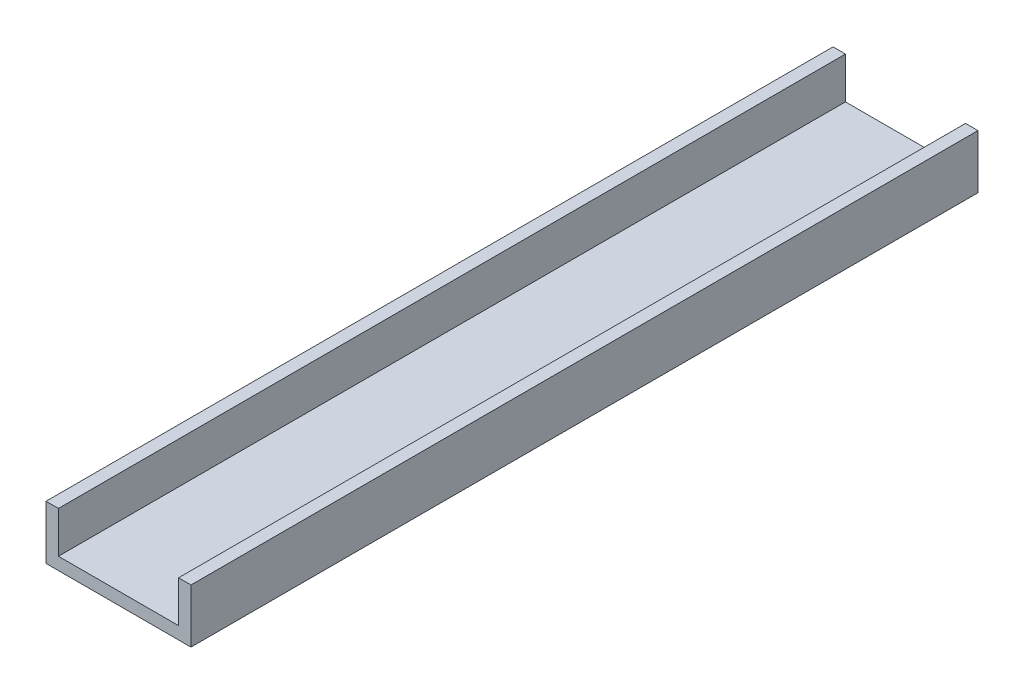
ISO-10303-21;
HEADER;
FILE_DESCRIPTION(('STEP AP214'),'2;1');
FILE_NAME('part.step','',(''),(''),'','','');
FILE_SCHEMA(('AUTOMOTIVE_DESIGN { 1 0 10303 214 1 1 1 1 }'));
ENDSEC;
DATA;
#1=APPLICATION_CONTEXT('core data for automotive mechanical design processes');
#2=APPLICATION_PROTOCOL_DEFINITION('international standard','automotive_design',2000,#1);
#3=PRODUCT_CONTEXT('',#1,'mechanical');
#4=PRODUCT('Part','Part','',(#3));
#5=PRODUCT_RELATED_PRODUCT_CATEGORY('part','',(#4));
#6=PRODUCT_DEFINITION_FORMATION('','',#4);
#7=PRODUCT_DEFINITION_CONTEXT('part definition',#1,'design');
#8=PRODUCT_DEFINITION('design','',#6,#7);
#9=PRODUCT_DEFINITION_SHAPE('','',#8);
#10=(LENGTH_UNIT() NAMED_UNIT(*) SI_UNIT(.MILLI.,.METRE.));
#11=(NAMED_UNIT(*) PLANE_ANGLE_UNIT() SI_UNIT($,.RADIAN.));
#12=(NAMED_UNIT(*) SI_UNIT($,.STERADIAN.) SOLID_ANGLE_UNIT());
#13=UNCERTAINTY_MEASURE_WITH_UNIT(LENGTH_MEASURE(1.E-05),#10,'distance_accuracy_value','');
#14=(GEOMETRIC_REPRESENTATION_CONTEXT(3) GLOBAL_UNCERTAINTY_ASSIGNED_CONTEXT((#13)) GLOBAL_UNIT_ASSIGNED_CONTEXT((#10,
#11,#12)) REPRESENTATION_CONTEXT('',''));
#15=CARTESIAN_POINT('',(0.,0.,0.));
#16=DIRECTION('',(0.,0.,1.));
#17=DIRECTION('',(1.,0.,0.));
#18=AXIS2_PLACEMENT_3D('',#15,#16,#17);
#19=CARTESIAN_POINT('',(0.,3.,0.));
#20=DIRECTION('',(0.,1.,0.));
#21=DIRECTION('',(0.,0.,1.));
#22=AXIS2_PLACEMENT_3D('',#19,#20,#21);
#23=PLANE('',#22);
#24=DIRECTION('',(1.,0.,0.));
#25=VECTOR('',#24,1.);
#26=CARTESIAN_POINT('',(0.,3.,190.));
#27=LINE('',#26,#25);
#28=CARTESIAN_POINT('',(3.00000000000001,3.,190.));
#29=VERTEX_POINT('',#28);
#30=CARTESIAN_POINT('',(32.,3.,190.));
#31=VERTEX_POINT('',#30);
#32=EDGE_CURVE('E53',#29,#31,#27,.T.);
#33=ORIENTED_EDGE('',*,*,#32,.T.);
#34=DIRECTION('',(0.,0.,1.));
#35=VECTOR('',#34,1.);
#36=CARTESIAN_POINT('',(32.,3.,0.));
#37=LINE('',#36,#35);
#38=CARTESIAN_POINT('',(32.,3.,0.));
#39=VERTEX_POINT('',#38);
#40=EDGE_CURVE('E48',#39,#31,#37,.T.);
#41=ORIENTED_EDGE('',*,*,#40,.F.);
#42=DIRECTION('',(-1.,0.,0.));
#43=VECTOR('',#42,1.);
#44=CARTESIAN_POINT('',(0.,3.,0.));
#45=LINE('',#44,#43);
#46=CARTESIAN_POINT('',(3.,3.,0.));
#47=VERTEX_POINT('',#46);
#48=EDGE_CURVE('E119',#39,#47,#45,.T.);
#49=ORIENTED_EDGE('',*,*,#48,.T.);
#50=DIRECTION('',(0.,0.,-1.));
#51=VECTOR('',#50,1.);
#52=CARTESIAN_POINT('',(3.,3.,0.));
#53=LINE('',#52,#51);
#54=EDGE_CURVE('E120',#29,#47,#53,.T.);
#55=ORIENTED_EDGE('',*,*,#54,.F.);
#56=EDGE_LOOP('',(#33,#41,#49,#55));
#57=FACE_BOUND('',#56,.T.);
#58=ADVANCED_FACE('F33',(#57),#23,.T.);
#59=CARTESIAN_POINT('',(0.,3.,0.));
#60=DIRECTION('',(1.,0.,0.));
#61=DIRECTION('',(0.,0.,-1.));
#62=AXIS2_PLACEMENT_3D('',#59,#60,#61);
#63=PLANE('',#62);
#64=DIRECTION('',(0.,0.,1.));
#65=VECTOR('',#64,1.);
#66=CARTESIAN_POINT('',(0.,0.,0.));
#67=LINE('',#66,#65);
#68=CARTESIAN_POINT('',(0.,0.,0.));
#69=VERTEX_POINT('',#68);
#70=CARTESIAN_POINT('',(0.,0.,190.));
#71=VERTEX_POINT('',#70);
#72=EDGE_CURVE('E142',#69,#71,#67,.T.);
#73=ORIENTED_EDGE('',*,*,#72,.T.);
#74=DIRECTION('',(0.,-1.,0.));
#75=VECTOR('',#74,1.);
#76=CARTESIAN_POINT('',(0.,3.,190.));
#77=LINE('',#76,#75);
#78=CARTESIAN_POINT('',(0.,13.,190.));
#79=VERTEX_POINT('',#78);
#80=EDGE_CURVE('E11',#79,#71,#77,.T.);
#81=ORIENTED_EDGE('',*,*,#80,.F.);
#82=DIRECTION('',(0.,0.,1.));
#83=VECTOR('',#82,1.);
#84=CARTESIAN_POINT('',(0.,13.,0.));
#85=LINE('',#84,#83);
#86=CARTESIAN_POINT('',(0.,13.,0.));
#87=VERTEX_POINT('',#86);
#88=EDGE_CURVE('E123',#87,#79,#85,.T.);
#89=ORIENTED_EDGE('',*,*,#88,.F.);
#90=DIRECTION('',(0.,-1.,0.));
#91=VECTOR('',#90,1.);
#92=CARTESIAN_POINT('',(0.,3.,0.));
#93=LINE('',#92,#91);
#94=EDGE_CURVE('E146',#87,#69,#93,.T.);
#95=ORIENTED_EDGE('',*,*,#94,.T.);
#96=EDGE_LOOP('',(#73,#81,#89,#95));
#97=FACE_BOUND('',#96,.T.);
#98=ADVANCED_FACE('F35',(#97),#63,.F.);
#99=CARTESIAN_POINT('',(0.,3.,190.));
#100=DIRECTION('',(0.,0.,-1.));
#101=DIRECTION('',(-1.,0.,0.));
#102=AXIS2_PLACEMENT_3D('',#99,#100,#101);
#103=PLANE('',#102);
#104=DIRECTION('',(1.,0.,0.));
#105=VECTOR('',#104,1.);
#106=CARTESIAN_POINT('',(0.,0.,190.));
#107=LINE('',#106,#105);
#108=CARTESIAN_POINT('',(35.,0.,190.));
#109=VERTEX_POINT('',#108);
#110=EDGE_CURVE('E149',#71,#109,#107,.T.);
#111=ORIENTED_EDGE('',*,*,#110,.T.);
#112=DIRECTION('',(0.,-1.,0.));
#113=VECTOR('',#112,1.);
#114=CARTESIAN_POINT('',(35.,3.,190.));
#115=LINE('',#114,#113);
#116=CARTESIAN_POINT('',(35.,13.,190.));
#117=VERTEX_POINT('',#116);
#118=EDGE_CURVE('E41',#117,#109,#115,.T.);
#119=ORIENTED_EDGE('',*,*,#118,.F.);
#120=DIRECTION('',(1.,0.,0.));
#121=VECTOR('',#120,1.);
#122=CARTESIAN_POINT('',(32.,13.,190.));
#123=LINE('',#122,#121);
#124=CARTESIAN_POINT('',(32.,13.,190.));
#125=VERTEX_POINT('',#124);
#126=EDGE_CURVE('E106',#125,#117,#123,.T.);
#127=ORIENTED_EDGE('',*,*,#126,.F.);
#128=DIRECTION('',(0.,-1.,0.));
#129=VECTOR('',#128,1.);
#130=CARTESIAN_POINT('',(32.,13.,190.));
#131=LINE('',#130,#129);
#132=EDGE_CURVE('E102',#125,#31,#131,.T.);
#133=ORIENTED_EDGE('',*,*,#132,.T.);
#134=ORIENTED_EDGE('',*,*,#32,.F.);
#135=DIRECTION('',(0.,-1.,0.));
#136=VECTOR('',#135,1.);
#137=CARTESIAN_POINT('',(3.00000000000002,13.,190.));
#138=LINE('',#137,#136);
#139=CARTESIAN_POINT('',(3.00000000000002,13.,190.));
#140=VERTEX_POINT('',#139);
#141=EDGE_CURVE('E139',#140,#29,#138,.T.);
#142=ORIENTED_EDGE('',*,*,#141,.F.);
#143=DIRECTION('',(1.,0.,0.));
#144=VECTOR('',#143,1.);
#145=CARTESIAN_POINT('',(0.,13.,190.));
#146=LINE('',#145,#144);
#147=EDGE_CURVE('E130',#79,#140,#146,.T.);
#148=ORIENTED_EDGE('',*,*,#147,.F.);
#149=ORIENTED_EDGE('',*,*,#80,.T.);
#150=EDGE_LOOP('',(#111,#119,#127,#133,#134,#142,#148,#149));
#151=FACE_BOUND('',#150,.T.);
#152=ADVANCED_FACE('F177',(#151),#103,.F.);
#153=CARTESIAN_POINT('',(35.,3.,0.));
#154=DIRECTION('',(-1.,0.,0.));
#155=DIRECTION('',(0.,0.,1.));
#156=AXIS2_PLACEMENT_3D('',#153,#154,#155);
#157=PLANE('',#156);
#158=DIRECTION('',(0.,0.,-1.));
#159=VECTOR('',#158,1.);
#160=CARTESIAN_POINT('',(35.,0.,0.));
#161=LINE('',#160,#159);
#162=CARTESIAN_POINT('',(35.,0.,0.));
#163=VERTEX_POINT('',#162);
#164=EDGE_CURVE('E151',#109,#163,#161,.T.);
#165=ORIENTED_EDGE('',*,*,#164,.T.);
#166=DIRECTION('',(0.,-1.,0.));
#167=VECTOR('',#166,1.);
#168=CARTESIAN_POINT('',(35.,3.,0.));
#169=LINE('',#168,#167);
#170=CARTESIAN_POINT('',(35.,13.,0.));
#171=VERTEX_POINT('',#170);
#172=EDGE_CURVE('E156',#171,#163,#169,.T.);
#173=ORIENTED_EDGE('',*,*,#172,.F.);
#174=DIRECTION('',(0.,0.,-1.));
#175=VECTOR('',#174,1.);
#176=CARTESIAN_POINT('',(35.,13.,0.));
#177=LINE('',#176,#175);
#178=EDGE_CURVE('E113',#117,#171,#177,.T.);
#179=ORIENTED_EDGE('',*,*,#178,.F.);
#180=ORIENTED_EDGE('',*,*,#118,.T.);
#181=EDGE_LOOP('',(#165,#173,#179,#180));
#182=FACE_BOUND('',#181,.T.);
#183=ADVANCED_FACE('F160',(#182),#157,.F.);
#184=CARTESIAN_POINT('',(0.,3.,0.));
#185=DIRECTION('',(0.,0.,1.));
#186=DIRECTION('',(1.,0.,0.));
#187=AXIS2_PLACEMENT_3D('',#184,#185,#186);
#188=PLANE('',#187);
#189=DIRECTION('',(-1.,0.,0.));
#190=VECTOR('',#189,1.);
#191=CARTESIAN_POINT('',(0.,0.,0.));
#192=LINE('',#191,#190);
#193=EDGE_CURVE('E144',#163,#69,#192,.T.);
#194=ORIENTED_EDGE('',*,*,#193,.T.);
#195=ORIENTED_EDGE('',*,*,#94,.F.);
#196=DIRECTION('',(-1.,0.,0.));
#197=VECTOR('',#196,1.);
#198=CARTESIAN_POINT('',(0.,13.,0.));
#199=LINE('',#198,#197);
#200=CARTESIAN_POINT('',(3.,13.,0.));
#201=VERTEX_POINT('',#200);
#202=EDGE_CURVE('E134',#201,#87,#199,.T.);
#203=ORIENTED_EDGE('',*,*,#202,.F.);
#204=DIRECTION('',(0.,-1.,0.));
#205=VECTOR('',#204,1.);
#206=CARTESIAN_POINT('',(3.,13.,0.));
#207=LINE('',#206,#205);
#208=EDGE_CURVE('E136',#201,#47,#207,.T.);
#209=ORIENTED_EDGE('',*,*,#208,.T.);
#210=ORIENTED_EDGE('',*,*,#48,.F.);
#211=DIRECTION('',(0.,-1.,0.));
#212=VECTOR('',#211,1.);
#213=CARTESIAN_POINT('',(32.,13.,0.));
#214=LINE('',#213,#212);
#215=CARTESIAN_POINT('',(32.,13.,0.));
#216=VERTEX_POINT('',#215);
#217=EDGE_CURVE('E100',#216,#39,#214,.T.);
#218=ORIENTED_EDGE('',*,*,#217,.F.);
#219=DIRECTION('',(-1.,0.,0.));
#220=VECTOR('',#219,1.);
#221=CARTESIAN_POINT('',(32.,13.,0.));
#222=LINE('',#221,#220);
#223=EDGE_CURVE('E107',#171,#216,#222,.T.);
#224=ORIENTED_EDGE('',*,*,#223,.F.);
#225=ORIENTED_EDGE('',*,*,#172,.T.);
#226=EDGE_LOOP('',(#194,#195,#203,#209,#210,#218,#224,#225));
#227=FACE_BOUND('',#226,.T.);
#228=ADVANCED_FACE('F117',(#227),#188,.F.);
#229=CARTESIAN_POINT('',(0.,0.,0.));
#230=DIRECTION('',(0.,1.,0.));
#231=DIRECTION('',(0.,0.,1.));
#232=AXIS2_PLACEMENT_3D('',#229,#230,#231);
#233=PLANE('',#232);
#234=ORIENTED_EDGE('',*,*,#72,.F.);
#235=ORIENTED_EDGE('',*,*,#193,.F.);
#236=ORIENTED_EDGE('',*,*,#164,.F.);
#237=ORIENTED_EDGE('',*,*,#110,.F.);
#238=EDGE_LOOP('',(#234,#235,#236,#237));
#239=FACE_BOUND('',#238,.T.);
#240=ADVANCED_FACE('F165',(#239),#233,.F.);
#241=CARTESIAN_POINT('',(3.,13.,0.));
#242=DIRECTION('',(-1.,0.,0.));
#243=DIRECTION('',(0.,0.,1.));
#244=AXIS2_PLACEMENT_3D('',#241,#242,#243);
#245=PLANE('',#244);
#246=ORIENTED_EDGE('',*,*,#54,.T.);
#247=ORIENTED_EDGE('',*,*,#208,.F.);
#248=DIRECTION('',(0.,0.,-1.));
#249=VECTOR('',#248,1.);
#250=CARTESIAN_POINT('',(3.,13.,0.));
#251=LINE('',#250,#249);
#252=EDGE_CURVE('E132',#140,#201,#251,.T.);
#253=ORIENTED_EDGE('',*,*,#252,.F.);
#254=ORIENTED_EDGE('',*,*,#141,.T.);
#255=EDGE_LOOP('',(#246,#247,#253,#254));
#256=FACE_BOUND('',#255,.T.);
#257=ADVANCED_FACE('F176',(#256),#245,.F.);
#258=CARTESIAN_POINT('',(0.,13.,0.));
#259=DIRECTION('',(0.,1.,0.));
#260=DIRECTION('',(0.,0.,1.));
#261=AXIS2_PLACEMENT_3D('',#258,#259,#260);
#262=PLANE('',#261);
#263=ORIENTED_EDGE('',*,*,#88,.T.);
#264=ORIENTED_EDGE('',*,*,#147,.T.);
#265=ORIENTED_EDGE('',*,*,#252,.T.);
#266=ORIENTED_EDGE('',*,*,#202,.T.);
#267=EDGE_LOOP('',(#263,#264,#265,#266));
#268=FACE_BOUND('',#267,.T.);
#269=ADVANCED_FACE('F171',(#268),#262,.T.);
#270=CARTESIAN_POINT('',(32.,13.,0.));
#271=DIRECTION('',(1.,0.,0.));
#272=DIRECTION('',(0.,0.,-1.));
#273=AXIS2_PLACEMENT_3D('',#270,#271,#272);
#274=PLANE('',#273);
#275=ORIENTED_EDGE('',*,*,#40,.T.);
#276=ORIENTED_EDGE('',*,*,#132,.F.);
#277=DIRECTION('',(0.,0.,1.));
#278=VECTOR('',#277,1.);
#279=CARTESIAN_POINT('',(32.,13.,0.));
#280=LINE('',#279,#278);
#281=EDGE_CURVE('E96',#216,#125,#280,.T.);
#282=ORIENTED_EDGE('',*,*,#281,.F.);
#283=ORIENTED_EDGE('',*,*,#217,.T.);
#284=EDGE_LOOP('',(#275,#276,#282,#283));
#285=FACE_BOUND('',#284,.T.);
#286=ADVANCED_FACE('F98',(#285),#274,.F.);
#287=CARTESIAN_POINT('',(0.,13.,0.));
#288=DIRECTION('',(0.,-1.,0.));
#289=DIRECTION('',(0.,0.,-1.));
#290=AXIS2_PLACEMENT_3D('',#287,#288,#289);
#291=PLANE('',#290);
#292=ORIENTED_EDGE('',*,*,#223,.T.);
#293=ORIENTED_EDGE('',*,*,#281,.T.);
#294=ORIENTED_EDGE('',*,*,#126,.T.);
#295=ORIENTED_EDGE('',*,*,#178,.T.);
#296=EDGE_LOOP('',(#292,#293,#294,#295));
#297=FACE_BOUND('',#296,.T.);
#298=ADVANCED_FACE('F111',(#297),#291,.F.);
#299=CLOSED_SHELL('',(#58,#98,#152,#183,#228,#240,#257,#269,#286,#298));
#300=MANIFOLD_SOLID_BREP('B2',#299);
#301=ADVANCED_BREP_SHAPE_REPRESENTATION('',(#18,#300),#14);
#302=SHAPE_DEFINITION_REPRESENTATION(#9,#301);
ENDSEC;
END-ISO-10303-21;
